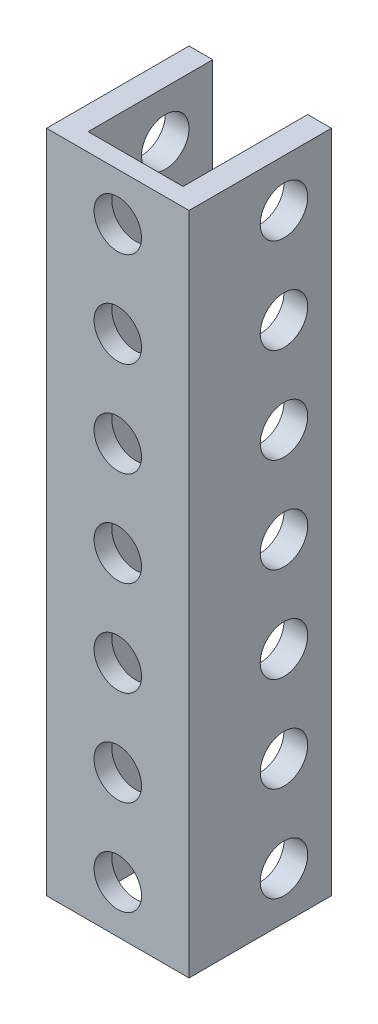
ISO-10303-21;
HEADER;
FILE_DESCRIPTION(('STEP AP214'),'2;1');
FILE_NAME('part.step','',(''),(''),'','','');
FILE_SCHEMA(('AUTOMOTIVE_DESIGN { 1 0 10303 214 1 1 1 1 }'));
ENDSEC;
DATA;
#1=APPLICATION_CONTEXT('core data for automotive mechanical design processes');
#2=APPLICATION_PROTOCOL_DEFINITION('international standard','automotive_design',2000,#1);
#3=PRODUCT_CONTEXT('',#1,'mechanical');
#4=PRODUCT('Part','Part','',(#3));
#5=PRODUCT_RELATED_PRODUCT_CATEGORY('part','',(#4));
#6=PRODUCT_DEFINITION_FORMATION('','',#4);
#7=PRODUCT_DEFINITION_CONTEXT('part definition',#1,'design');
#8=PRODUCT_DEFINITION('design','',#6,#7);
#9=PRODUCT_DEFINITION_SHAPE('','',#8);
#10=(LENGTH_UNIT() NAMED_UNIT(*) SI_UNIT(.MILLI.,.METRE.));
#11=(NAMED_UNIT(*) PLANE_ANGLE_UNIT() SI_UNIT($,.RADIAN.));
#12=(NAMED_UNIT(*) SI_UNIT($,.STERADIAN.) SOLID_ANGLE_UNIT());
#13=UNCERTAINTY_MEASURE_WITH_UNIT(LENGTH_MEASURE(1.E-05),#10,'distance_accuracy_value','');
#14=(GEOMETRIC_REPRESENTATION_CONTEXT(3) GLOBAL_UNCERTAINTY_ASSIGNED_CONTEXT((#13)) GLOBAL_UNIT_ASSIGNED_CONTEXT((#10,
#11,#12)) REPRESENTATION_CONTEXT('',''));
#15=CARTESIAN_POINT('',(0.,0.,0.));
#16=DIRECTION('',(0.,0.,1.));
#17=DIRECTION('',(1.,0.,0.));
#18=AXIS2_PLACEMENT_3D('',#15,#16,#17);
#19=CARTESIAN_POINT('',(-6.,12.,-6.5));
#20=DIRECTION('',(-1.,0.,0.));
#21=DIRECTION('',(0.,0.,1.));
#22=AXIS2_PLACEMENT_3D('',#19,#20,#21);
#23=CYLINDRICAL_SURFACE('',#22,1.99999999999999);
#24=CARTESIAN_POINT('',(4.,12.,-6.5));
#25=DIRECTION('',(-1.,0.,0.));
#26=DIRECTION('',(0.,0.,1.));
#27=AXIS2_PLACEMENT_3D('',#24,#25,#26);
#28=CIRCLE('',#27,1.99999999999999);
#29=CARTESIAN_POINT('',(4.,12.,-4.50000000000001));
#30=VERTEX_POINT('',#29);
#31=EDGE_CURVE('E128',#30,#30,#28,.T.);
#32=ORIENTED_EDGE('',*,*,#31,.T.);
#33=EDGE_LOOP('',(#32));
#34=FACE_BOUND('',#33,.T.);
#35=CARTESIAN_POINT('',(6.,12.,-6.5));
#36=DIRECTION('',(-1.,0.,0.));
#37=DIRECTION('',(0.,0.,1.));
#38=AXIS2_PLACEMENT_3D('',#35,#36,#37);
#39=CIRCLE('',#38,1.99999999999999);
#40=CARTESIAN_POINT('',(6.,12.,-4.50000000000001));
#41=VERTEX_POINT('',#40);
#42=EDGE_CURVE('E20',#41,#41,#39,.F.);
#43=ORIENTED_EDGE('',*,*,#42,.T.);
#44=EDGE_LOOP('',(#43));
#45=FACE_BOUND('',#44,.T.);
#46=ADVANCED_FACE('F17',(#34,#45),#23,.F.);
#47=CARTESIAN_POINT('',(-6.,4.,-6.5));
#48=DIRECTION('',(-1.,0.,0.));
#49=DIRECTION('',(0.,0.,1.));
#50=AXIS2_PLACEMENT_3D('',#47,#48,#49);
#51=CYLINDRICAL_SURFACE('',#50,1.99999999999999);
#52=CARTESIAN_POINT('',(4.,4.,-6.5));
#53=DIRECTION('',(-1.,0.,0.));
#54=DIRECTION('',(0.,0.,1.));
#55=AXIS2_PLACEMENT_3D('',#52,#53,#54);
#56=CIRCLE('',#55,1.99999999999999);
#57=CARTESIAN_POINT('',(4.,4.,-4.50000000000001));
#58=VERTEX_POINT('',#57);
#59=EDGE_CURVE('E125',#58,#58,#56,.T.);
#60=ORIENTED_EDGE('',*,*,#59,.T.);
#61=EDGE_LOOP('',(#60));
#62=FACE_BOUND('',#61,.T.);
#63=CARTESIAN_POINT('',(6.,4.,-6.5));
#64=DIRECTION('',(-1.,0.,0.));
#65=DIRECTION('',(0.,0.,1.));
#66=AXIS2_PLACEMENT_3D('',#63,#64,#65);
#67=CIRCLE('',#66,1.99999999999999);
#68=CARTESIAN_POINT('',(6.,4.,-4.50000000000001));
#69=VERTEX_POINT('',#68);
#70=EDGE_CURVE('E241',#69,#69,#67,.F.);
#71=ORIENTED_EDGE('',*,*,#70,.T.);
#72=EDGE_LOOP('',(#71));
#73=FACE_BOUND('',#72,.T.);
#74=ADVANCED_FACE('F344',(#62,#73),#51,.F.);
#75=CARTESIAN_POINT('',(-6.,20.,-6.5));
#76=DIRECTION('',(-1.,0.,0.));
#77=DIRECTION('',(0.,0.,1.));
#78=AXIS2_PLACEMENT_3D('',#75,#76,#77);
#79=CYLINDRICAL_SURFACE('',#78,1.99999999999999);
#80=CARTESIAN_POINT('',(4.,20.,-6.5));
#81=DIRECTION('',(-1.,0.,0.));
#82=DIRECTION('',(0.,0.,1.));
#83=AXIS2_PLACEMENT_3D('',#80,#81,#82);
#84=CIRCLE('',#83,1.99999999999999);
#85=CARTESIAN_POINT('',(4.,20.,-4.50000000000001));
#86=VERTEX_POINT('',#85);
#87=EDGE_CURVE('E124',#86,#86,#84,.T.);
#88=ORIENTED_EDGE('',*,*,#87,.T.);
#89=EDGE_LOOP('',(#88));
#90=FACE_BOUND('',#89,.T.);
#91=CARTESIAN_POINT('',(6.,20.,-6.5));
#92=DIRECTION('',(-1.,0.,0.));
#93=DIRECTION('',(0.,0.,1.));
#94=AXIS2_PLACEMENT_3D('',#91,#92,#93);
#95=CIRCLE('',#94,1.99999999999999);
#96=CARTESIAN_POINT('',(6.,20.,-4.50000000000001));
#97=VERTEX_POINT('',#96);
#98=EDGE_CURVE('E239',#97,#97,#95,.F.);
#99=ORIENTED_EDGE('',*,*,#98,.T.);
#100=EDGE_LOOP('',(#99));
#101=FACE_BOUND('',#100,.T.);
#102=ADVANCED_FACE('F347',(#90,#101),#79,.F.);
#103=CARTESIAN_POINT('',(-6.,28.,-6.5));
#104=DIRECTION('',(-1.,0.,0.));
#105=DIRECTION('',(0.,0.,1.));
#106=AXIS2_PLACEMENT_3D('',#103,#104,#105);
#107=CYLINDRICAL_SURFACE('',#106,1.99999999999999);
#108=CARTESIAN_POINT('',(4.,28.,-6.5));
#109=DIRECTION('',(-1.,0.,0.));
#110=DIRECTION('',(0.,0.,1.));
#111=AXIS2_PLACEMENT_3D('',#108,#109,#110);
#112=CIRCLE('',#111,1.99999999999999);
#113=CARTESIAN_POINT('',(4.,28.,-4.50000000000001));
#114=VERTEX_POINT('',#113);
#115=EDGE_CURVE('E219',#114,#114,#112,.T.);
#116=ORIENTED_EDGE('',*,*,#115,.T.);
#117=EDGE_LOOP('',(#116));
#118=FACE_BOUND('',#117,.T.);
#119=CARTESIAN_POINT('',(6.,28.,-6.5));
#120=DIRECTION('',(-1.,0.,0.));
#121=DIRECTION('',(0.,0.,1.));
#122=AXIS2_PLACEMENT_3D('',#119,#120,#121);
#123=CIRCLE('',#122,1.99999999999999);
#124=CARTESIAN_POINT('',(6.,28.,-4.50000000000001));
#125=VERTEX_POINT('',#124);
#126=EDGE_CURVE('E236',#125,#125,#123,.F.);
#127=ORIENTED_EDGE('',*,*,#126,.T.);
#128=EDGE_LOOP('',(#127));
#129=FACE_BOUND('',#128,.T.);
#130=ADVANCED_FACE('F352',(#118,#129),#107,.F.);
#131=CARTESIAN_POINT('',(-6.,36.,-6.5));
#132=DIRECTION('',(-1.,0.,0.));
#133=DIRECTION('',(0.,0.,1.));
#134=AXIS2_PLACEMENT_3D('',#131,#132,#133);
#135=CYLINDRICAL_SURFACE('',#134,1.99999999999999);
#136=CARTESIAN_POINT('',(4.,36.,-6.5));
#137=DIRECTION('',(-1.,0.,0.));
#138=DIRECTION('',(0.,0.,1.));
#139=AXIS2_PLACEMENT_3D('',#136,#137,#138);
#140=CIRCLE('',#139,1.99999999999999);
#141=CARTESIAN_POINT('',(4.,36.,-4.50000000000001));
#142=VERTEX_POINT('',#141);
#143=EDGE_CURVE('E216',#142,#142,#140,.T.);
#144=ORIENTED_EDGE('',*,*,#143,.T.);
#145=EDGE_LOOP('',(#144));
#146=FACE_BOUND('',#145,.T.);
#147=CARTESIAN_POINT('',(6.,36.,-6.5));
#148=DIRECTION('',(-1.,0.,0.));
#149=DIRECTION('',(0.,0.,1.));
#150=AXIS2_PLACEMENT_3D('',#147,#148,#149);
#151=CIRCLE('',#150,1.99999999999999);
#152=CARTESIAN_POINT('',(6.,36.,-4.50000000000001));
#153=VERTEX_POINT('',#152);
#154=EDGE_CURVE('E233',#153,#153,#151,.F.);
#155=ORIENTED_EDGE('',*,*,#154,.T.);
#156=EDGE_LOOP('',(#155));
#157=FACE_BOUND('',#156,.T.);
#158=ADVANCED_FACE('F358',(#146,#157),#135,.F.);
#159=CARTESIAN_POINT('',(-6.,44.,-6.5));
#160=DIRECTION('',(-1.,0.,0.));
#161=DIRECTION('',(0.,0.,1.));
#162=AXIS2_PLACEMENT_3D('',#159,#160,#161);
#163=CYLINDRICAL_SURFACE('',#162,1.99999999999999);
#164=CARTESIAN_POINT('',(4.,44.,-6.5));
#165=DIRECTION('',(-1.,0.,0.));
#166=DIRECTION('',(0.,0.,1.));
#167=AXIS2_PLACEMENT_3D('',#164,#165,#166);
#168=CIRCLE('',#167,1.99999999999999);
#169=CARTESIAN_POINT('',(4.,44.,-4.50000000000001));
#170=VERTEX_POINT('',#169);
#171=EDGE_CURVE('E213',#170,#170,#168,.T.);
#172=ORIENTED_EDGE('',*,*,#171,.T.);
#173=EDGE_LOOP('',(#172));
#174=FACE_BOUND('',#173,.T.);
#175=CARTESIAN_POINT('',(6.,44.,-6.5));
#176=DIRECTION('',(-1.,0.,0.));
#177=DIRECTION('',(0.,0.,1.));
#178=AXIS2_PLACEMENT_3D('',#175,#176,#177);
#179=CIRCLE('',#178,1.99999999999999);
#180=CARTESIAN_POINT('',(6.,44.,-4.50000000000001));
#181=VERTEX_POINT('',#180);
#182=EDGE_CURVE('E230',#181,#181,#179,.F.);
#183=ORIENTED_EDGE('',*,*,#182,.T.);
#184=EDGE_LOOP('',(#183));
#185=FACE_BOUND('',#184,.T.);
#186=ADVANCED_FACE('F362',(#174,#185),#163,.F.);
#187=CARTESIAN_POINT('',(-6.,52.,-6.5));
#188=DIRECTION('',(-1.,0.,0.));
#189=DIRECTION('',(0.,0.,1.));
#190=AXIS2_PLACEMENT_3D('',#187,#188,#189);
#191=CYLINDRICAL_SURFACE('',#190,1.99999999999999);
#192=CARTESIAN_POINT('',(4.,52.,-6.5));
#193=DIRECTION('',(-1.,0.,0.));
#194=DIRECTION('',(0.,0.,1.));
#195=AXIS2_PLACEMENT_3D('',#192,#193,#194);
#196=CIRCLE('',#195,1.99999999999999);
#197=CARTESIAN_POINT('',(4.,52.,-4.50000000000001));
#198=VERTEX_POINT('',#197);
#199=EDGE_CURVE('E210',#198,#198,#196,.T.);
#200=ORIENTED_EDGE('',*,*,#199,.T.);
#201=EDGE_LOOP('',(#200));
#202=FACE_BOUND('',#201,.T.);
#203=CARTESIAN_POINT('',(6.,52.,-6.5));
#204=DIRECTION('',(-1.,0.,0.));
#205=DIRECTION('',(0.,0.,1.));
#206=AXIS2_PLACEMENT_3D('',#203,#204,#205);
#207=CIRCLE('',#206,1.99999999999999);
#208=CARTESIAN_POINT('',(6.,52.,-4.50000000000001));
#209=VERTEX_POINT('',#208);
#210=EDGE_CURVE('E129',#209,#209,#207,.F.);
#211=ORIENTED_EDGE('',*,*,#210,.T.);
#212=EDGE_LOOP('',(#211));
#213=FACE_BOUND('',#212,.T.);
#214=ADVANCED_FACE('F366',(#202,#213),#191,.F.);
#215=CARTESIAN_POINT('',(0.,52.,1.5));
#216=DIRECTION('',(0.,0.,1.));
#217=DIRECTION('',(1.,0.,0.));
#218=AXIS2_PLACEMENT_3D('',#215,#216,#217);
#219=CYLINDRICAL_SURFACE('',#218,1.99999999999999);
#220=CARTESIAN_POINT('',(0.,52.,0.));
#221=DIRECTION('',(0.,0.,1.));
#222=DIRECTION('',(1.,0.,0.));
#223=AXIS2_PLACEMENT_3D('',#220,#221,#222);
#224=CIRCLE('',#223,1.99999999999999);
#225=CARTESIAN_POINT('',(1.99999999999999,52.,0.));
#226=VERTEX_POINT('',#225);
#227=EDGE_CURVE('E207',#226,#226,#224,.F.);
#228=ORIENTED_EDGE('',*,*,#227,.T.);
#229=EDGE_LOOP('',(#228));
#230=FACE_BOUND('',#229,.T.);
#231=CARTESIAN_POINT('',(0.,52.,1.5));
#232=DIRECTION('',(0.,0.,1.));
#233=DIRECTION('',(1.,0.,0.));
#234=AXIS2_PLACEMENT_3D('',#231,#232,#233);
#235=CIRCLE('',#234,1.99999999999999);
#236=CARTESIAN_POINT('',(1.99999999999999,52.,1.5));
#237=VERTEX_POINT('',#236);
#238=EDGE_CURVE('E183',#237,#237,#235,.T.);
#239=ORIENTED_EDGE('',*,*,#238,.T.);
#240=EDGE_LOOP('',(#239));
#241=FACE_BOUND('',#240,.T.);
#242=ADVANCED_FACE('F370',(#230,#241),#219,.F.);
#243=CARTESIAN_POINT('',(0.,44.,1.5));
#244=DIRECTION('',(0.,0.,1.));
#245=DIRECTION('',(1.,0.,0.));
#246=AXIS2_PLACEMENT_3D('',#243,#244,#245);
#247=CYLINDRICAL_SURFACE('',#246,1.99999999999999);
#248=CARTESIAN_POINT('',(0.,44.,0.));
#249=DIRECTION('',(0.,0.,1.));
#250=DIRECTION('',(1.,0.,0.));
#251=AXIS2_PLACEMENT_3D('',#248,#249,#250);
#252=CIRCLE('',#251,1.99999999999999);
#253=CARTESIAN_POINT('',(1.99999999999999,44.,0.));
#254=VERTEX_POINT('',#253);
#255=EDGE_CURVE('E204',#254,#254,#252,.F.);
#256=ORIENTED_EDGE('',*,*,#255,.T.);
#257=EDGE_LOOP('',(#256));
#258=FACE_BOUND('',#257,.T.);
#259=CARTESIAN_POINT('',(0.,44.,1.5));
#260=DIRECTION('',(0.,0.,1.));
#261=DIRECTION('',(1.,0.,0.));
#262=AXIS2_PLACEMENT_3D('',#259,#260,#261);
#263=CIRCLE('',#262,1.99999999999999);
#264=CARTESIAN_POINT('',(1.99999999999999,44.,1.5));
#265=VERTEX_POINT('',#264);
#266=EDGE_CURVE('E180',#265,#265,#263,.T.);
#267=ORIENTED_EDGE('',*,*,#266,.T.);
#268=EDGE_LOOP('',(#267));
#269=FACE_BOUND('',#268,.T.);
#270=ADVANCED_FACE('F374',(#258,#269),#247,.F.);
#271=CARTESIAN_POINT('',(0.,36.,1.5));
#272=DIRECTION('',(0.,0.,1.));
#273=DIRECTION('',(1.,0.,0.));
#274=AXIS2_PLACEMENT_3D('',#271,#272,#273);
#275=CYLINDRICAL_SURFACE('',#274,1.99999999999999);
#276=CARTESIAN_POINT('',(0.,36.,0.));
#277=DIRECTION('',(0.,0.,1.));
#278=DIRECTION('',(1.,0.,0.));
#279=AXIS2_PLACEMENT_3D('',#276,#277,#278);
#280=CIRCLE('',#279,1.99999999999999);
#281=CARTESIAN_POINT('',(1.99999999999999,36.,0.));
#282=VERTEX_POINT('',#281);
#283=EDGE_CURVE('E201',#282,#282,#280,.F.);
#284=ORIENTED_EDGE('',*,*,#283,.T.);
#285=EDGE_LOOP('',(#284));
#286=FACE_BOUND('',#285,.T.);
#287=CARTESIAN_POINT('',(0.,36.,1.5));
#288=DIRECTION('',(0.,0.,1.));
#289=DIRECTION('',(1.,0.,0.));
#290=AXIS2_PLACEMENT_3D('',#287,#288,#289);
#291=CIRCLE('',#290,1.99999999999999);
#292=CARTESIAN_POINT('',(1.99999999999999,36.,1.5));
#293=VERTEX_POINT('',#292);
#294=EDGE_CURVE('E177',#293,#293,#291,.T.);
#295=ORIENTED_EDGE('',*,*,#294,.T.);
#296=EDGE_LOOP('',(#295));
#297=FACE_BOUND('',#296,.T.);
#298=ADVANCED_FACE('F378',(#286,#297),#275,.F.);
#299=CARTESIAN_POINT('',(0.,28.,1.5));
#300=DIRECTION('',(0.,0.,1.));
#301=DIRECTION('',(1.,0.,0.));
#302=AXIS2_PLACEMENT_3D('',#299,#300,#301);
#303=CYLINDRICAL_SURFACE('',#302,1.99999999999999);
#304=CARTESIAN_POINT('',(0.,28.,0.));
#305=DIRECTION('',(0.,0.,1.));
#306=DIRECTION('',(1.,0.,0.));
#307=AXIS2_PLACEMENT_3D('',#304,#305,#306);
#308=CIRCLE('',#307,1.99999999999999);
#309=CARTESIAN_POINT('',(1.99999999999999,28.,0.));
#310=VERTEX_POINT('',#309);
#311=EDGE_CURVE('E198',#310,#310,#308,.F.);
#312=ORIENTED_EDGE('',*,*,#311,.T.);
#313=EDGE_LOOP('',(#312));
#314=FACE_BOUND('',#313,.T.);
#315=CARTESIAN_POINT('',(0.,28.,1.5));
#316=DIRECTION('',(0.,0.,1.));
#317=DIRECTION('',(1.,0.,0.));
#318=AXIS2_PLACEMENT_3D('',#315,#316,#317);
#319=CIRCLE('',#318,1.99999999999999);
#320=CARTESIAN_POINT('',(1.99999999999999,28.,1.5));
#321=VERTEX_POINT('',#320);
#322=EDGE_CURVE('E174',#321,#321,#319,.T.);
#323=ORIENTED_EDGE('',*,*,#322,.T.);
#324=EDGE_LOOP('',(#323));
#325=FACE_BOUND('',#324,.T.);
#326=ADVANCED_FACE('F382',(#314,#325),#303,.F.);
#327=CARTESIAN_POINT('',(0.,20.,1.5));
#328=DIRECTION('',(0.,0.,1.));
#329=DIRECTION('',(1.,0.,0.));
#330=AXIS2_PLACEMENT_3D('',#327,#328,#329);
#331=CYLINDRICAL_SURFACE('',#330,1.99999999999999);
#332=CARTESIAN_POINT('',(0.,20.,0.));
#333=DIRECTION('',(0.,0.,1.));
#334=DIRECTION('',(1.,0.,0.));
#335=AXIS2_PLACEMENT_3D('',#332,#333,#334);
#336=CIRCLE('',#335,1.99999999999999);
#337=CARTESIAN_POINT('',(1.99999999999999,20.,0.));
#338=VERTEX_POINT('',#337);
#339=EDGE_CURVE('E195',#338,#338,#336,.F.);
#340=ORIENTED_EDGE('',*,*,#339,.T.);
#341=EDGE_LOOP('',(#340));
#342=FACE_BOUND('',#341,.T.);
#343=CARTESIAN_POINT('',(0.,20.,1.5));
#344=DIRECTION('',(0.,0.,1.));
#345=DIRECTION('',(1.,0.,0.));
#346=AXIS2_PLACEMENT_3D('',#343,#344,#345);
#347=CIRCLE('',#346,1.99999999999999);
#348=CARTESIAN_POINT('',(1.99999999999999,20.,1.5));
#349=VERTEX_POINT('',#348);
#350=EDGE_CURVE('E171',#349,#349,#347,.T.);
#351=ORIENTED_EDGE('',*,*,#350,.T.);
#352=EDGE_LOOP('',(#351));
#353=FACE_BOUND('',#352,.T.);
#354=ADVANCED_FACE('F386',(#342,#353),#331,.F.);
#355=CARTESIAN_POINT('',(0.,12.,1.5));
#356=DIRECTION('',(0.,0.,1.));
#357=DIRECTION('',(1.,0.,0.));
#358=AXIS2_PLACEMENT_3D('',#355,#356,#357);
#359=CYLINDRICAL_SURFACE('',#358,1.99999999999999);
#360=CARTESIAN_POINT('',(0.,12.,0.));
#361=DIRECTION('',(0.,0.,1.));
#362=DIRECTION('',(1.,0.,0.));
#363=AXIS2_PLACEMENT_3D('',#360,#361,#362);
#364=CIRCLE('',#363,1.99999999999999);
#365=CARTESIAN_POINT('',(1.99999999999999,12.,0.));
#366=VERTEX_POINT('',#365);
#367=EDGE_CURVE('E192',#366,#366,#364,.F.);
#368=ORIENTED_EDGE('',*,*,#367,.T.);
#369=EDGE_LOOP('',(#368));
#370=FACE_BOUND('',#369,.T.);
#371=CARTESIAN_POINT('',(0.,12.,1.5));
#372=DIRECTION('',(0.,0.,1.));
#373=DIRECTION('',(1.,0.,0.));
#374=AXIS2_PLACEMENT_3D('',#371,#372,#373);
#375=CIRCLE('',#374,1.99999999999999);
#376=CARTESIAN_POINT('',(1.99999999999999,12.,1.5));
#377=VERTEX_POINT('',#376);
#378=EDGE_CURVE('E168',#377,#377,#375,.T.);
#379=ORIENTED_EDGE('',*,*,#378,.T.);
#380=EDGE_LOOP('',(#379));
#381=FACE_BOUND('',#380,.T.);
#382=ADVANCED_FACE('F263',(#370,#381),#359,.F.);
#383=CARTESIAN_POINT('',(0.,4.,1.5));
#384=DIRECTION('',(0.,0.,1.));
#385=DIRECTION('',(1.,0.,0.));
#386=AXIS2_PLACEMENT_3D('',#383,#384,#385);
#387=CYLINDRICAL_SURFACE('',#386,1.99999999999999);
#388=CARTESIAN_POINT('',(0.,4.,0.));
#389=DIRECTION('',(0.,0.,1.));
#390=DIRECTION('',(1.,0.,0.));
#391=AXIS2_PLACEMENT_3D('',#388,#389,#390);
#392=CIRCLE('',#391,1.99999999999999);
#393=CARTESIAN_POINT('',(1.99999999999999,4.,0.));
#394=VERTEX_POINT('',#393);
#395=EDGE_CURVE('E120',#394,#394,#392,.F.);
#396=ORIENTED_EDGE('',*,*,#395,.T.);
#397=EDGE_LOOP('',(#396));
#398=FACE_BOUND('',#397,.T.);
#399=CARTESIAN_POINT('',(0.,4.,1.5));
#400=DIRECTION('',(0.,0.,1.));
#401=DIRECTION('',(1.,0.,0.));
#402=AXIS2_PLACEMENT_3D('',#399,#400,#401);
#403=CIRCLE('',#402,1.99999999999999);
#404=CARTESIAN_POINT('',(1.99999999999999,4.,1.5));
#405=VERTEX_POINT('',#404);
#406=EDGE_CURVE('E164',#405,#405,#403,.T.);
#407=ORIENTED_EDGE('',*,*,#406,.T.);
#408=EDGE_LOOP('',(#407));
#409=FACE_BOUND('',#408,.T.);
#410=ADVANCED_FACE('F252',(#398,#409),#387,.F.);
#411=CARTESIAN_POINT('',(6.,8.,-10.5));
#412=DIRECTION('',(-1.,0.,0.));
#413=DIRECTION('',(0.,0.,1.));
#414=AXIS2_PLACEMENT_3D('',#411,#412,#413);
#415=PLANE('',#414);
#416=ORIENTED_EDGE('',*,*,#210,.F.);
#417=EDGE_LOOP('',(#416));
#418=FACE_BOUND('',#417,.T.);
#419=ORIENTED_EDGE('',*,*,#182,.F.);
#420=EDGE_LOOP('',(#419));
#421=FACE_BOUND('',#420,.T.);
#422=ORIENTED_EDGE('',*,*,#154,.F.);
#423=EDGE_LOOP('',(#422));
#424=FACE_BOUND('',#423,.T.);
#425=ORIENTED_EDGE('',*,*,#126,.F.);
#426=EDGE_LOOP('',(#425));
#427=FACE_BOUND('',#426,.T.);
#428=ORIENTED_EDGE('',*,*,#98,.F.);
#429=EDGE_LOOP('',(#428));
#430=FACE_BOUND('',#429,.T.);
#431=DIRECTION('',(0.,1.,0.));
#432=VECTOR('',#431,1.);
#433=CARTESIAN_POINT('',(6.,8.,-10.5));
#434=LINE('',#433,#432);
#435=CARTESIAN_POINT('',(6.,0.,-10.5));
#436=VERTEX_POINT('',#435);
#437=CARTESIAN_POINT('',(6.,56.,-10.5));
#438=VERTEX_POINT('',#437);
#439=EDGE_CURVE('E126',#436,#438,#434,.T.);
#440=ORIENTED_EDGE('',*,*,#439,.T.);
#441=DIRECTION('',(0.,0.,1.));
#442=VECTOR('',#441,1.);
#443=CARTESIAN_POINT('',(6.,56.,0.));
#444=LINE('',#443,#442);
#445=CARTESIAN_POINT('',(6.,56.,1.5));
#446=VERTEX_POINT('',#445);
#447=EDGE_CURVE('E109',#446,#438,#444,.F.);
#448=ORIENTED_EDGE('',*,*,#447,.F.);
#449=DIRECTION('',(0.,1.,0.));
#450=VECTOR('',#449,1.);
#451=CARTESIAN_POINT('',(6.,8.,1.5));
#452=LINE('',#451,#450);
#453=CARTESIAN_POINT('',(6.,0.,1.5));
#454=VERTEX_POINT('',#453);
#455=EDGE_CURVE('E633',#446,#454,#452,.F.);
#456=ORIENTED_EDGE('',*,*,#455,.T.);
#457=DIRECTION('',(0.,0.,1.));
#458=VECTOR('',#457,1.);
#459=CARTESIAN_POINT('',(6.,0.,0.));
#460=LINE('',#459,#458);
#461=EDGE_CURVE('E624',#454,#436,#460,.F.);
#462=ORIENTED_EDGE('',*,*,#461,.T.);
#463=EDGE_LOOP('',(#440,#448,#456,#462));
#464=FACE_BOUND('',#463,.T.);
#465=ORIENTED_EDGE('',*,*,#70,.F.);
#466=EDGE_LOOP('',(#465));
#467=FACE_BOUND('',#466,.T.);
#468=ORIENTED_EDGE('',*,*,#42,.F.);
#469=EDGE_LOOP('',(#468));
#470=FACE_BOUND('',#469,.T.);
#471=ADVANCED_FACE('F249',(#418,#421,#424,#427,#430,#464,#467,#470),#415,.F.);
#472=CARTESIAN_POINT('',(4.,8.,-10.5));
#473=DIRECTION('',(0.,0.,1.));
#474=DIRECTION('',(1.,0.,0.));
#475=AXIS2_PLACEMENT_3D('',#472,#473,#474);
#476=PLANE('',#475);
#477=DIRECTION('',(0.,1.,0.));
#478=VECTOR('',#477,1.);
#479=CARTESIAN_POINT('',(4.,8.,-10.5));
#480=LINE('',#479,#478);
#481=CARTESIAN_POINT('',(4.,0.,-10.5));
#482=VERTEX_POINT('',#481);
#483=CARTESIAN_POINT('',(4.,56.,-10.5));
#484=VERTEX_POINT('',#483);
#485=EDGE_CURVE('E121',#482,#484,#480,.T.);
#486=ORIENTED_EDGE('',*,*,#485,.T.);
#487=DIRECTION('',(1.,0.,0.));
#488=VECTOR('',#487,1.);
#489=CARTESIAN_POINT('',(0.,56.,-10.5));
#490=LINE('',#489,#488);
#491=EDGE_CURVE('E111',#438,#484,#490,.F.);
#492=ORIENTED_EDGE('',*,*,#491,.F.);
#493=ORIENTED_EDGE('',*,*,#439,.F.);
#494=DIRECTION('',(1.,0.,0.));
#495=VECTOR('',#494,1.);
#496=CARTESIAN_POINT('',(0.,0.,-10.5));
#497=LINE('',#496,#495);
#498=EDGE_CURVE('E639',#436,#482,#497,.F.);
#499=ORIENTED_EDGE('',*,*,#498,.T.);
#500=EDGE_LOOP('',(#486,#492,#493,#499));
#501=FACE_BOUND('',#500,.T.);
#502=ADVANCED_FACE('F251',(#501),#476,.F.);
#503=CARTESIAN_POINT('',(4.,8.,0.));
#504=DIRECTION('',(1.,0.,0.));
#505=DIRECTION('',(0.,0.,-1.));
#506=AXIS2_PLACEMENT_3D('',#503,#504,#505);
#507=PLANE('',#506);
#508=ORIENTED_EDGE('',*,*,#199,.F.);
#509=EDGE_LOOP('',(#508));
#510=FACE_BOUND('',#509,.T.);
#511=ORIENTED_EDGE('',*,*,#171,.F.);
#512=EDGE_LOOP('',(#511));
#513=FACE_BOUND('',#512,.T.);
#514=ORIENTED_EDGE('',*,*,#143,.F.);
#515=EDGE_LOOP('',(#514));
#516=FACE_BOUND('',#515,.T.);
#517=ORIENTED_EDGE('',*,*,#115,.F.);
#518=EDGE_LOOP('',(#517));
#519=FACE_BOUND('',#518,.T.);
#520=ORIENTED_EDGE('',*,*,#87,.F.);
#521=EDGE_LOOP('',(#520));
#522=FACE_BOUND('',#521,.T.);
#523=DIRECTION('',(0.,1.,0.));
#524=VECTOR('',#523,1.);
#525=CARTESIAN_POINT('',(4.,8.,0.));
#526=LINE('',#525,#524);
#527=CARTESIAN_POINT('',(4.,0.,0.));
#528=VERTEX_POINT('',#527);
#529=CARTESIAN_POINT('',(4.,56.,0.));
#530=VERTEX_POINT('',#529);
#531=EDGE_CURVE('E117',#528,#530,#526,.T.);
#532=ORIENTED_EDGE('',*,*,#531,.T.);
#533=DIRECTION('',(0.,0.,1.));
#534=VECTOR('',#533,1.);
#535=CARTESIAN_POINT('',(4.,56.,0.));
#536=LINE('',#535,#534);
#537=EDGE_CURVE('E627',#484,#530,#536,.T.);
#538=ORIENTED_EDGE('',*,*,#537,.F.);
#539=ORIENTED_EDGE('',*,*,#485,.F.);
#540=DIRECTION('',(0.,0.,1.));
#541=VECTOR('',#540,1.);
#542=CARTESIAN_POINT('',(4.,0.,0.));
#543=LINE('',#542,#541);
#544=EDGE_CURVE('E641',#482,#528,#543,.T.);
#545=ORIENTED_EDGE('',*,*,#544,.T.);
#546=EDGE_LOOP('',(#532,#538,#539,#545));
#547=FACE_BOUND('',#546,.T.);
#548=ORIENTED_EDGE('',*,*,#59,.F.);
#549=EDGE_LOOP('',(#548));
#550=FACE_BOUND('',#549,.T.);
#551=ORIENTED_EDGE('',*,*,#31,.F.);
#552=EDGE_LOOP('',(#551));
#553=FACE_BOUND('',#552,.T.);
#554=ADVANCED_FACE('F260',(#510,#513,#516,#519,#522,#547,#550,#553),#507,.F.);
#555=CARTESIAN_POINT('',(4.,8.,0.));
#556=DIRECTION('',(0.,0.,1.));
#557=DIRECTION('',(1.,0.,0.));
#558=AXIS2_PLACEMENT_3D('',#555,#556,#557);
#559=PLANE('',#558);
#560=DIRECTION('',(0.,1.,0.));
#561=VECTOR('',#560,1.);
#562=CARTESIAN_POINT('',(-4.,8.,0.));
#563=LINE('',#562,#561);
#564=CARTESIAN_POINT('',(-4.,0.,0.));
#565=VERTEX_POINT('',#564);
#566=CARTESIAN_POINT('',(-4.,56.,0.));
#567=VERTEX_POINT('',#566);
#568=EDGE_CURVE('E80',#565,#567,#563,.T.);
#569=ORIENTED_EDGE('',*,*,#568,.T.);
#570=DIRECTION('',(1.,0.,0.));
#571=VECTOR('',#570,1.);
#572=CARTESIAN_POINT('',(0.,56.,0.));
#573=LINE('',#572,#571);
#574=EDGE_CURVE('E92',#530,#567,#573,.F.);
#575=ORIENTED_EDGE('',*,*,#574,.F.);
#576=ORIENTED_EDGE('',*,*,#531,.F.);
#577=DIRECTION('',(1.,0.,0.));
#578=VECTOR('',#577,1.);
#579=CARTESIAN_POINT('',(0.,0.,0.));
#580=LINE('',#579,#578);
#581=EDGE_CURVE('E643',#528,#565,#580,.F.);
#582=ORIENTED_EDGE('',*,*,#581,.T.);
#583=EDGE_LOOP('',(#569,#575,#576,#582));
#584=FACE_BOUND('',#583,.T.);
#585=ORIENTED_EDGE('',*,*,#395,.F.);
#586=EDGE_LOOP('',(#585));
#587=FACE_BOUND('',#586,.T.);
#588=ORIENTED_EDGE('',*,*,#367,.F.);
#589=EDGE_LOOP('',(#588));
#590=FACE_BOUND('',#589,.T.);
#591=ORIENTED_EDGE('',*,*,#339,.F.);
#592=EDGE_LOOP('',(#591));
#593=FACE_BOUND('',#592,.T.);
#594=ORIENTED_EDGE('',*,*,#311,.F.);
#595=EDGE_LOOP('',(#594));
#596=FACE_BOUND('',#595,.T.);
#597=ORIENTED_EDGE('',*,*,#283,.F.);
#598=EDGE_LOOP('',(#597));
#599=FACE_BOUND('',#598,.T.);
#600=ORIENTED_EDGE('',*,*,#255,.F.);
#601=EDGE_LOOP('',(#600));
#602=FACE_BOUND('',#601,.T.);
#603=ORIENTED_EDGE('',*,*,#227,.F.);
#604=EDGE_LOOP('',(#603));
#605=FACE_BOUND('',#604,.T.);
#606=ADVANCED_FACE('F318',(#584,#587,#590,#593,#596,#599,#602,#605),#559,.F.);
#607=CARTESIAN_POINT('',(-4.,8.,0.));
#608=DIRECTION('',(-1.,0.,0.));
#609=DIRECTION('',(0.,0.,1.));
#610=AXIS2_PLACEMENT_3D('',#607,#608,#609);
#611=PLANE('',#610);
#612=CARTESIAN_POINT('',(-4.,52.,-6.5));
#613=DIRECTION('',(-1.,0.,0.));
#614=DIRECTION('',(0.,0.,1.));
#615=AXIS2_PLACEMENT_3D('',#612,#613,#614);
#616=CIRCLE('',#615,1.99999999999999);
#617=CARTESIAN_POINT('',(-4.,52.,-4.5));
#618=VERTEX_POINT('',#617);
#619=EDGE_CURVE('E149',#618,#618,#616,.T.);
#620=ORIENTED_EDGE('',*,*,#619,.T.);
#621=EDGE_LOOP('',(#620));
#622=FACE_BOUND('',#621,.T.);
#623=CARTESIAN_POINT('',(-4.,44.,-6.5));
#624=DIRECTION('',(-1.,0.,0.));
#625=DIRECTION('',(0.,0.,1.));
#626=AXIS2_PLACEMENT_3D('',#623,#624,#625);
#627=CIRCLE('',#626,1.99999999999999);
#628=CARTESIAN_POINT('',(-4.,44.,-4.5));
#629=VERTEX_POINT('',#628);
#630=EDGE_CURVE('E152',#629,#629,#627,.T.);
#631=ORIENTED_EDGE('',*,*,#630,.T.);
#632=EDGE_LOOP('',(#631));
#633=FACE_BOUND('',#632,.T.);
#634=CARTESIAN_POINT('',(-4.,36.,-6.5));
#635=DIRECTION('',(-1.,0.,0.));
#636=DIRECTION('',(0.,0.,1.));
#637=AXIS2_PLACEMENT_3D('',#634,#635,#636);
#638=CIRCLE('',#637,1.99999999999999);
#639=CARTESIAN_POINT('',(-4.,36.,-4.5));
#640=VERTEX_POINT('',#639);
#641=EDGE_CURVE('E155',#640,#640,#638,.T.);
#642=ORIENTED_EDGE('',*,*,#641,.T.);
#643=EDGE_LOOP('',(#642));
#644=FACE_BOUND('',#643,.T.);
#645=CARTESIAN_POINT('',(-4.,28.,-6.5));
#646=DIRECTION('',(-1.,0.,0.));
#647=DIRECTION('',(0.,0.,1.));
#648=AXIS2_PLACEMENT_3D('',#645,#646,#647);
#649=CIRCLE('',#648,1.99999999999999);
#650=CARTESIAN_POINT('',(-4.,28.,-4.5));
#651=VERTEX_POINT('',#650);
#652=EDGE_CURVE('E158',#651,#651,#649,.T.);
#653=ORIENTED_EDGE('',*,*,#652,.T.);
#654=EDGE_LOOP('',(#653));
#655=FACE_BOUND('',#654,.T.);
#656=CARTESIAN_POINT('',(-4.,20.,-6.5));
#657=DIRECTION('',(-1.,0.,0.));
#658=DIRECTION('',(0.,0.,1.));
#659=AXIS2_PLACEMENT_3D('',#656,#657,#658);
#660=CIRCLE('',#659,1.99999999999999);
#661=CARTESIAN_POINT('',(-4.,20.,-4.5));
#662=VERTEX_POINT('',#661);
#663=EDGE_CURVE('E161',#662,#662,#660,.T.);
#664=ORIENTED_EDGE('',*,*,#663,.T.);
#665=EDGE_LOOP('',(#664));
#666=FACE_BOUND('',#665,.T.);
#667=DIRECTION('',(0.,1.,0.));
#668=VECTOR('',#667,1.);
#669=CARTESIAN_POINT('',(-4.,8.,-10.5));
#670=LINE('',#669,#668);
#671=CARTESIAN_POINT('',(-4.,0.,-10.5));
#672=VERTEX_POINT('',#671);
#673=CARTESIAN_POINT('',(-4.,56.,-10.5));
#674=VERTEX_POINT('',#673);
#675=EDGE_CURVE('E94',#672,#674,#670,.T.);
#676=ORIENTED_EDGE('',*,*,#675,.T.);
#677=DIRECTION('',(0.,0.,1.));
#678=VECTOR('',#677,1.);
#679=CARTESIAN_POINT('',(-4.,56.,0.));
#680=LINE('',#679,#678);
#681=EDGE_CURVE('E85',#567,#674,#680,.F.);
#682=ORIENTED_EDGE('',*,*,#681,.F.);
#683=ORIENTED_EDGE('',*,*,#568,.F.);
#684=DIRECTION('',(0.,0.,1.));
#685=VECTOR('',#684,1.);
#686=CARTESIAN_POINT('',(-4.,0.,0.));
#687=LINE('',#686,#685);
#688=EDGE_CURVE('E100',#565,#672,#687,.F.);
#689=ORIENTED_EDGE('',*,*,#688,.T.);
#690=EDGE_LOOP('',(#676,#682,#683,#689));
#691=FACE_BOUND('',#690,.T.);
#692=CARTESIAN_POINT('',(-4.,4.,-6.5));
#693=DIRECTION('',(-1.,0.,0.));
#694=DIRECTION('',(0.,0.,1.));
#695=AXIS2_PLACEMENT_3D('',#692,#693,#694);
#696=CIRCLE('',#695,1.99999999999999);
#697=CARTESIAN_POINT('',(-4.,4.,-4.5));
#698=VERTEX_POINT('',#697);
#699=EDGE_CURVE('E104',#698,#698,#696,.T.);
#700=ORIENTED_EDGE('',*,*,#699,.T.);
#701=EDGE_LOOP('',(#700));
#702=FACE_BOUND('',#701,.T.);
#703=CARTESIAN_POINT('',(-4.,12.,-6.5));
#704=DIRECTION('',(-1.,0.,0.));
#705=DIRECTION('',(0.,0.,1.));
#706=AXIS2_PLACEMENT_3D('',#703,#704,#705);
#707=CIRCLE('',#706,1.99999999999999);
#708=CARTESIAN_POINT('',(-4.,12.,-4.5));
#709=VERTEX_POINT('',#708);
#710=EDGE_CURVE('E116',#709,#709,#707,.T.);
#711=ORIENTED_EDGE('',*,*,#710,.T.);
#712=EDGE_LOOP('',(#711));
#713=FACE_BOUND('',#712,.T.);
#714=ADVANCED_FACE('F97',(#622,#633,#644,#655,#666,#691,#702,#713),#611,.F.);
#715=CARTESIAN_POINT('',(-6.,12.,-6.5));
#716=DIRECTION('',(-1.,0.,0.));
#717=DIRECTION('',(0.,0.,1.));
#718=AXIS2_PLACEMENT_3D('',#715,#716,#717);
#719=CYLINDRICAL_SURFACE('',#718,1.99999999999999);
#720=ORIENTED_EDGE('',*,*,#710,.F.);
#721=EDGE_LOOP('',(#720));
#722=FACE_BOUND('',#721,.T.);
#723=CARTESIAN_POINT('',(-6.,12.,-6.5));
#724=DIRECTION('',(-1.,0.,0.));
#725=DIRECTION('',(0.,0.,1.));
#726=AXIS2_PLACEMENT_3D('',#723,#724,#725);
#727=CIRCLE('',#726,1.99999999999999);
#728=CARTESIAN_POINT('',(-6.,12.,-4.5));
#729=VERTEX_POINT('',#728);
#730=EDGE_CURVE('E146',#729,#729,#727,.T.);
#731=ORIENTED_EDGE('',*,*,#730,.T.);
#732=EDGE_LOOP('',(#731));
#733=FACE_BOUND('',#732,.T.);
#734=ADVANCED_FACE('F311',(#722,#733),#719,.F.);
#735=CARTESIAN_POINT('',(-6.,4.,-6.5));
#736=DIRECTION('',(-1.,0.,0.));
#737=DIRECTION('',(0.,0.,1.));
#738=AXIS2_PLACEMENT_3D('',#735,#736,#737);
#739=CYLINDRICAL_SURFACE('',#738,1.99999999999999);
#740=ORIENTED_EDGE('',*,*,#699,.F.);
#741=EDGE_LOOP('',(#740));
#742=FACE_BOUND('',#741,.T.);
#743=CARTESIAN_POINT('',(-6.,4.,-6.5));
#744=DIRECTION('',(-1.,0.,0.));
#745=DIRECTION('',(0.,0.,1.));
#746=AXIS2_PLACEMENT_3D('',#743,#744,#745);
#747=CIRCLE('',#746,1.99999999999999);
#748=CARTESIAN_POINT('',(-6.,4.,-4.5));
#749=VERTEX_POINT('',#748);
#750=EDGE_CURVE('E143',#749,#749,#747,.T.);
#751=ORIENTED_EDGE('',*,*,#750,.T.);
#752=EDGE_LOOP('',(#751));
#753=FACE_BOUND('',#752,.T.);
#754=ADVANCED_FACE('F308',(#742,#753),#739,.F.);
#755=CARTESIAN_POINT('',(-4.,8.,-10.5));
#756=DIRECTION('',(0.,0.,1.));
#757=DIRECTION('',(1.,0.,0.));
#758=AXIS2_PLACEMENT_3D('',#755,#756,#757);
#759=PLANE('',#758);
#760=DIRECTION('',(0.,1.,0.));
#761=VECTOR('',#760,1.);
#762=CARTESIAN_POINT('',(-6.,8.,-10.5));
#763=LINE('',#762,#761);
#764=CARTESIAN_POINT('',(-6.,0.,-10.5));
#765=VERTEX_POINT('',#764);
#766=CARTESIAN_POINT('',(-6.,56.,-10.5));
#767=VERTEX_POINT('',#766);
#768=EDGE_CURVE('E108',#765,#767,#763,.T.);
#769=ORIENTED_EDGE('',*,*,#768,.T.);
#770=DIRECTION('',(1.,0.,0.));
#771=VECTOR('',#770,1.);
#772=CARTESIAN_POINT('',(0.,56.,-10.5));
#773=LINE('',#772,#771);
#774=EDGE_CURVE('E90',#674,#767,#773,.F.);
#775=ORIENTED_EDGE('',*,*,#774,.F.);
#776=ORIENTED_EDGE('',*,*,#675,.F.);
#777=DIRECTION('',(1.,0.,0.));
#778=VECTOR('',#777,1.);
#779=CARTESIAN_POINT('',(0.,0.,-10.5));
#780=LINE('',#779,#778);
#781=EDGE_CURVE('E635',#672,#765,#780,.F.);
#782=ORIENTED_EDGE('',*,*,#781,.T.);
#783=EDGE_LOOP('',(#769,#775,#776,#782));
#784=FACE_BOUND('',#783,.T.);
#785=ADVANCED_FACE('F107',(#784),#759,.F.);
#786=CARTESIAN_POINT('',(0.,56.,0.));
#787=DIRECTION('',(0.,1.,0.));
#788=DIRECTION('',(0.,0.,1.));
#789=AXIS2_PLACEMENT_3D('',#786,#787,#788);
#790=PLANE('',#789);
#791=ORIENTED_EDGE('',*,*,#537,.T.);
#792=ORIENTED_EDGE('',*,*,#574,.T.);
#793=ORIENTED_EDGE('',*,*,#681,.T.);
#794=ORIENTED_EDGE('',*,*,#774,.T.);
#795=DIRECTION('',(0.,0.,-1.));
#796=VECTOR('',#795,1.);
#797=CARTESIAN_POINT('',(-6.,56.,-10.5));
#798=LINE('',#797,#796);
#799=CARTESIAN_POINT('',(-6.,56.,1.5));
#800=VERTEX_POINT('',#799);
#801=EDGE_CURVE('E647',#767,#800,#798,.F.);
#802=ORIENTED_EDGE('',*,*,#801,.T.);
#803=DIRECTION('',(-1.,0.,0.));
#804=VECTOR('',#803,1.);
#805=CARTESIAN_POINT('',(-6.,56.,1.5));
#806=LINE('',#805,#804);
#807=EDGE_CURVE('E167',#800,#446,#806,.F.);
#808=ORIENTED_EDGE('',*,*,#807,.T.);
#809=ORIENTED_EDGE('',*,*,#447,.T.);
#810=ORIENTED_EDGE('',*,*,#491,.T.);
#811=EDGE_LOOP('',(#791,#792,#793,#794,#802,#808,#809,#810));
#812=FACE_BOUND('',#811,.T.);
#813=ADVANCED_FACE('F87',(#812),#790,.T.);
#814=CARTESIAN_POINT('',(-6.,8.,1.5));
#815=DIRECTION('',(0.,0.,-1.));
#816=DIRECTION('',(-1.,0.,0.));
#817=AXIS2_PLACEMENT_3D('',#814,#815,#816);
#818=PLANE('',#817);
#819=ORIENTED_EDGE('',*,*,#455,.F.);
#820=ORIENTED_EDGE('',*,*,#807,.F.);
#821=DIRECTION('',(0.,1.,0.));
#822=VECTOR('',#821,1.);
#823=CARTESIAN_POINT('',(-6.,8.,1.5));
#824=LINE('',#823,#822);
#825=CARTESIAN_POINT('',(-6.,0.,1.5));
#826=VERTEX_POINT('',#825);
#827=EDGE_CURVE('E649',#800,#826,#824,.F.);
#828=ORIENTED_EDGE('',*,*,#827,.T.);
#829=DIRECTION('',(1.,0.,0.));
#830=VECTOR('',#829,1.);
#831=CARTESIAN_POINT('',(0.,0.,1.5));
#832=LINE('',#831,#830);
#833=EDGE_CURVE('E35',#826,#454,#832,.T.);
#834=ORIENTED_EDGE('',*,*,#833,.T.);
#835=EDGE_LOOP('',(#819,#820,#828,#834));
#836=FACE_BOUND('',#835,.T.);
#837=ORIENTED_EDGE('',*,*,#406,.F.);
#838=EDGE_LOOP('',(#837));
#839=FACE_BOUND('',#838,.T.);
#840=ORIENTED_EDGE('',*,*,#378,.F.);
#841=EDGE_LOOP('',(#840));
#842=FACE_BOUND('',#841,.T.);
#843=ORIENTED_EDGE('',*,*,#350,.F.);
#844=EDGE_LOOP('',(#843));
#845=FACE_BOUND('',#844,.T.);
#846=ORIENTED_EDGE('',*,*,#322,.F.);
#847=EDGE_LOOP('',(#846));
#848=FACE_BOUND('',#847,.T.);
#849=ORIENTED_EDGE('',*,*,#294,.F.);
#850=EDGE_LOOP('',(#849));
#851=FACE_BOUND('',#850,.T.);
#852=ORIENTED_EDGE('',*,*,#266,.F.);
#853=EDGE_LOOP('',(#852));
#854=FACE_BOUND('',#853,.T.);
#855=ORIENTED_EDGE('',*,*,#238,.F.);
#856=EDGE_LOOP('',(#855));
#857=FACE_BOUND('',#856,.T.);
#858=ADVANCED_FACE('F300',(#836,#839,#842,#845,#848,#851,#854,#857),#818,.F.);
#859=CARTESIAN_POINT('',(0.,0.,0.));
#860=DIRECTION('',(0.,1.,0.));
#861=DIRECTION('',(0.,0.,1.));
#862=AXIS2_PLACEMENT_3D('',#859,#860,#861);
#863=PLANE('',#862);
#864=ORIENTED_EDGE('',*,*,#581,.F.);
#865=ORIENTED_EDGE('',*,*,#544,.F.);
#866=ORIENTED_EDGE('',*,*,#498,.F.);
#867=ORIENTED_EDGE('',*,*,#461,.F.);
#868=ORIENTED_EDGE('',*,*,#833,.F.);
#869=DIRECTION('',(0.,0.,-1.));
#870=VECTOR('',#869,1.);
#871=CARTESIAN_POINT('',(-6.,0.,-10.5));
#872=LINE('',#871,#870);
#873=EDGE_CURVE('E142',#826,#765,#872,.T.);
#874=ORIENTED_EDGE('',*,*,#873,.T.);
#875=ORIENTED_EDGE('',*,*,#781,.F.);
#876=ORIENTED_EDGE('',*,*,#688,.F.);
#877=EDGE_LOOP('',(#864,#865,#866,#867,#868,#874,#875,#876));
#878=FACE_BOUND('',#877,.T.);
#879=ADVANCED_FACE('F296',(#878),#863,.F.);
#880=CARTESIAN_POINT('',(-6.,20.,-6.5));
#881=DIRECTION('',(-1.,0.,0.));
#882=DIRECTION('',(0.,0.,1.));
#883=AXIS2_PLACEMENT_3D('',#880,#881,#882);
#884=CYLINDRICAL_SURFACE('',#883,1.99999999999999);
#885=ORIENTED_EDGE('',*,*,#663,.F.);
#886=EDGE_LOOP('',(#885));
#887=FACE_BOUND('',#886,.T.);
#888=CARTESIAN_POINT('',(-6.,20.,-6.5));
#889=DIRECTION('',(-1.,0.,0.));
#890=DIRECTION('',(0.,0.,1.));
#891=AXIS2_PLACEMENT_3D('',#888,#889,#890);
#892=CIRCLE('',#891,1.99999999999999);
#893=CARTESIAN_POINT('',(-6.,20.,-4.5));
#894=VERTEX_POINT('',#893);
#895=EDGE_CURVE('E139',#894,#894,#892,.T.);
#896=ORIENTED_EDGE('',*,*,#895,.T.);
#897=EDGE_LOOP('',(#896));
#898=FACE_BOUND('',#897,.T.);
#899=ADVANCED_FACE('F292',(#887,#898),#884,.F.);
#900=CARTESIAN_POINT('',(-6.,28.,-6.5));
#901=DIRECTION('',(-1.,0.,0.));
#902=DIRECTION('',(0.,0.,1.));
#903=AXIS2_PLACEMENT_3D('',#900,#901,#902);
#904=CYLINDRICAL_SURFACE('',#903,1.99999999999999);
#905=ORIENTED_EDGE('',*,*,#652,.F.);
#906=EDGE_LOOP('',(#905));
#907=FACE_BOUND('',#906,.T.);
#908=CARTESIAN_POINT('',(-6.,28.,-6.5));
#909=DIRECTION('',(-1.,0.,0.));
#910=DIRECTION('',(0.,0.,1.));
#911=AXIS2_PLACEMENT_3D('',#908,#909,#910);
#912=CIRCLE('',#911,1.99999999999999);
#913=CARTESIAN_POINT('',(-6.,28.,-4.5));
#914=VERTEX_POINT('',#913);
#915=EDGE_CURVE('E136',#914,#914,#912,.T.);
#916=ORIENTED_EDGE('',*,*,#915,.T.);
#917=EDGE_LOOP('',(#916));
#918=FACE_BOUND('',#917,.T.);
#919=ADVANCED_FACE('F288',(#907,#918),#904,.F.);
#920=CARTESIAN_POINT('',(-6.,36.,-6.5));
#921=DIRECTION('',(-1.,0.,0.));
#922=DIRECTION('',(0.,0.,1.));
#923=AXIS2_PLACEMENT_3D('',#920,#921,#922);
#924=CYLINDRICAL_SURFACE('',#923,1.99999999999999);
#925=ORIENTED_EDGE('',*,*,#641,.F.);
#926=EDGE_LOOP('',(#925));
#927=FACE_BOUND('',#926,.T.);
#928=CARTESIAN_POINT('',(-6.,36.,-6.5));
#929=DIRECTION('',(-1.,0.,0.));
#930=DIRECTION('',(0.,0.,1.));
#931=AXIS2_PLACEMENT_3D('',#928,#929,#930);
#932=CIRCLE('',#931,1.99999999999999);
#933=CARTESIAN_POINT('',(-6.,36.,-4.5));
#934=VERTEX_POINT('',#933);
#935=EDGE_CURVE('E133',#934,#934,#932,.T.);
#936=ORIENTED_EDGE('',*,*,#935,.T.);
#937=EDGE_LOOP('',(#936));
#938=FACE_BOUND('',#937,.T.);
#939=ADVANCED_FACE('F284',(#927,#938),#924,.F.);
#940=CARTESIAN_POINT('',(-6.,44.,-6.5));
#941=DIRECTION('',(-1.,0.,0.));
#942=DIRECTION('',(0.,0.,1.));
#943=AXIS2_PLACEMENT_3D('',#940,#941,#942);
#944=CYLINDRICAL_SURFACE('',#943,1.99999999999999);
#945=ORIENTED_EDGE('',*,*,#630,.F.);
#946=EDGE_LOOP('',(#945));
#947=FACE_BOUND('',#946,.T.);
#948=CARTESIAN_POINT('',(-6.,44.,-6.5));
#949=DIRECTION('',(-1.,0.,0.));
#950=DIRECTION('',(0.,0.,1.));
#951=AXIS2_PLACEMENT_3D('',#948,#949,#950);
#952=CIRCLE('',#951,1.99999999999999);
#953=CARTESIAN_POINT('',(-6.,44.,-4.5));
#954=VERTEX_POINT('',#953);
#955=EDGE_CURVE('E26',#954,#954,#952,.T.);
#956=ORIENTED_EDGE('',*,*,#955,.T.);
#957=EDGE_LOOP('',(#956));
#958=FACE_BOUND('',#957,.T.);
#959=ADVANCED_FACE('F276',(#947,#958),#944,.F.);
#960=CARTESIAN_POINT('',(-6.,52.,-6.5));
#961=DIRECTION('',(-1.,0.,0.));
#962=DIRECTION('',(0.,0.,1.));
#963=AXIS2_PLACEMENT_3D('',#960,#961,#962);
#964=CYLINDRICAL_SURFACE('',#963,1.99999999999999);
#965=ORIENTED_EDGE('',*,*,#619,.F.);
#966=EDGE_LOOP('',(#965));
#967=FACE_BOUND('',#966,.T.);
#968=CARTESIAN_POINT('',(-6.,52.,-6.5));
#969=DIRECTION('',(-1.,0.,0.));
#970=DIRECTION('',(0.,0.,1.));
#971=AXIS2_PLACEMENT_3D('',#968,#969,#970);
#972=CIRCLE('',#971,1.99999999999999);
#973=CARTESIAN_POINT('',(-6.,52.,-4.5));
#974=VERTEX_POINT('',#973);
#975=EDGE_CURVE('E10',#974,#974,#972,.T.);
#976=ORIENTED_EDGE('',*,*,#975,.T.);
#977=EDGE_LOOP('',(#976));
#978=FACE_BOUND('',#977,.T.);
#979=ADVANCED_FACE('F270',(#967,#978),#964,.F.);
#980=CARTESIAN_POINT('',(-6.,8.,-10.5));
#981=DIRECTION('',(1.,0.,0.));
#982=DIRECTION('',(0.,0.,-1.));
#983=AXIS2_PLACEMENT_3D('',#980,#981,#982);
#984=PLANE('',#983);
#985=ORIENTED_EDGE('',*,*,#975,.F.);
#986=EDGE_LOOP('',(#985));
#987=FACE_BOUND('',#986,.T.);
#988=ORIENTED_EDGE('',*,*,#955,.F.);
#989=EDGE_LOOP('',(#988));
#990=FACE_BOUND('',#989,.T.);
#991=ORIENTED_EDGE('',*,*,#935,.F.);
#992=EDGE_LOOP('',(#991));
#993=FACE_BOUND('',#992,.T.);
#994=ORIENTED_EDGE('',*,*,#915,.F.);
#995=EDGE_LOOP('',(#994));
#996=FACE_BOUND('',#995,.T.);
#997=ORIENTED_EDGE('',*,*,#895,.F.);
#998=EDGE_LOOP('',(#997));
#999=FACE_BOUND('',#998,.T.);
#1000=ORIENTED_EDGE('',*,*,#827,.F.);
#1001=ORIENTED_EDGE('',*,*,#801,.F.);
#1002=ORIENTED_EDGE('',*,*,#768,.F.);
#1003=ORIENTED_EDGE('',*,*,#873,.F.);
#1004=EDGE_LOOP('',(#1000,#1001,#1002,#1003));
#1005=FACE_BOUND('',#1004,.T.);
#1006=ORIENTED_EDGE('',*,*,#750,.F.);
#1007=EDGE_LOOP('',(#1006));
#1008=FACE_BOUND('',#1007,.T.);
#1009=ORIENTED_EDGE('',*,*,#730,.F.);
#1010=EDGE_LOOP('',(#1009));
#1011=FACE_BOUND('',#1010,.T.);
#1012=ADVANCED_FACE('F268',(#987,#990,#993,#996,#999,#1005,#1008,#1011),#984,.F.);
#1013=CLOSED_SHELL('',(#46,#74,#102,#130,#158,#186,#214,#242,#270,#298,#326,#354,#382,#410,#471,
#502,#554,#606,#714,#734,#754,#785,#813,#858,#879,#899,#919,#939,#959,#979,#1012));
#1014=MANIFOLD_SOLID_BREP('B1',#1013);
#1015=ADVANCED_BREP_SHAPE_REPRESENTATION('',(#18,#1014),#14);
#1016=SHAPE_DEFINITION_REPRESENTATION(#9,#1015);
ENDSEC;
END-ISO-10303-21;
